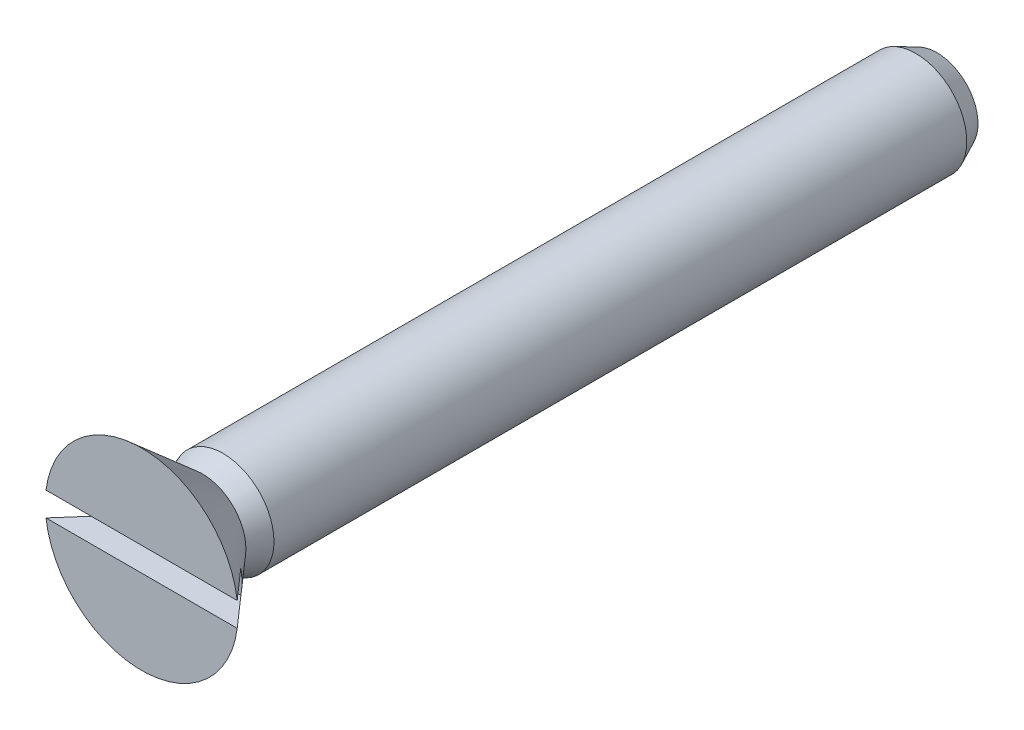
ISO-10303-21;
HEADER;
FILE_DESCRIPTION(('STEP AP214'),'2;1');
FILE_NAME('part.step','',(''),(''),'','','');
FILE_SCHEMA(('AUTOMOTIVE_DESIGN { 1 0 10303 214 1 1 1 1 }'));
ENDSEC;
DATA;
#1=APPLICATION_CONTEXT('core data for automotive mechanical design processes');
#2=APPLICATION_PROTOCOL_DEFINITION('international standard','automotive_design',2000,#1);
#3=PRODUCT_CONTEXT('',#1,'mechanical');
#4=PRODUCT('Part','Part','',(#3));
#5=PRODUCT_RELATED_PRODUCT_CATEGORY('part','',(#4));
#6=PRODUCT_DEFINITION_FORMATION('','',#4);
#7=PRODUCT_DEFINITION_CONTEXT('part definition',#1,'design');
#8=PRODUCT_DEFINITION('design','',#6,#7);
#9=PRODUCT_DEFINITION_SHAPE('','',#8);
#10=(LENGTH_UNIT() NAMED_UNIT(*) SI_UNIT(.MILLI.,.METRE.));
#11=(NAMED_UNIT(*) PLANE_ANGLE_UNIT() SI_UNIT($,.RADIAN.));
#12=(NAMED_UNIT(*) SI_UNIT($,.STERADIAN.) SOLID_ANGLE_UNIT());
#13=UNCERTAINTY_MEASURE_WITH_UNIT(LENGTH_MEASURE(1.E-05),#10,'distance_accuracy_value','');
#14=(GEOMETRIC_REPRESENTATION_CONTEXT(3) GLOBAL_UNCERTAINTY_ASSIGNED_CONTEXT((#13)) GLOBAL_UNIT_ASSIGNED_CONTEXT((#10,
#11,#12)) REPRESENTATION_CONTEXT('',''));
#15=CARTESIAN_POINT('',(0.,0.,0.));
#16=DIRECTION('',(0.,0.,1.));
#17=DIRECTION('',(1.,0.,0.));
#18=AXIS2_PLACEMENT_3D('',#15,#16,#17);
#19=CARTESIAN_POINT('',(-2.703338205,-2.7065351,1.7018));
#20=DIRECTION('',(0.,0.,1.));
#21=DIRECTION('',(1.,0.,0.));
#22=AXIS2_PLACEMENT_3D('',#19,#20,#21);
#23=PLANE('',#22);
#24=DIRECTION('',(-1.,0.,0.));
#25=VECTOR('',#24,1.);
#26=CARTESIAN_POINT('',(0.,-0.33655,1.7018));
#27=LINE('',#26,#25);
#28=CARTESIAN_POINT('',(2.6712828109945,-0.33655,1.70179999974678));
#29=VERTEX_POINT('',#28);
#30=CARTESIAN_POINT('',(-2.6712828112164,-0.33655,1.70180000000004));
#31=VERTEX_POINT('',#30);
#32=EDGE_CURVE('E68',#29,#31,#27,.T.);
#33=ORIENTED_EDGE('',*,*,#32,.T.);
#34=CARTESIAN_POINT('',(0.,0.,1.70180000000009));
#35=DIRECTION('',(0.,0.,1.));
#36=DIRECTION('',(1.,0.,0.));
#37=AXIS2_PLACEMENT_3D('',#34,#35,#36);
#38=CIRCLE('',#37,2.69240000000007);
#39=EDGE_CURVE('E21',#31,#29,#38,.T.);
#40=ORIENTED_EDGE('',*,*,#39,.T.);
#41=EDGE_LOOP('',(#33,#40));
#42=FACE_BOUND('',#41,.T.);
#43=ADVANCED_FACE('F17',(#42),#23,.T.);
#44=CARTESIAN_POINT('',(-2.703338205,-0.33655,1.7018));
#45=DIRECTION('',(0.,-1.,0.));
#46=DIRECTION('',(0.,0.,-1.));
#47=AXIS2_PLACEMENT_3D('',#44,#45,#46);
#48=PLANE('',#47);
#49=CARTESIAN_POINT('',(1.92350325844433,-0.33655,0.850899999862454));
#50=CARTESIAN_POINT('',(1.9859639495517,-0.33655,0.921680159299777));
#51=CARTESIAN_POINT('',(2.04837643865772,-0.33655,0.992502813507704));
#52=CARTESIAN_POINT('',(2.17312353425763,-0.33655,1.13421658957777));
#53=CARTESIAN_POINT('',(2.23545814081127,-0.33655,1.20510771138731));
#54=CARTESIAN_POINT('',(2.36006806783732,-0.33655,1.34694198593339));
#55=CARTESIAN_POINT('',(2.42234338832941,-0.33655,1.41788513865265));
#56=CARTESIAN_POINT('',(2.54684616813442,-0.33655,1.55981352687141));
#57=CARTESIAN_POINT('',(2.60907362741087,-0.33655,1.63079876240291));
#58=CARTESIAN_POINT('',(2.67128281077197,-0.33655,1.70179999949279));
#59=B_SPLINE_CURVE_WITH_KNOTS('',3,(#49,#50,#51,#52,#53,#54,#55,#56,#57,#58),.UNSPECIFIED.,.F.,
.F.,(4,2,2,2,4),(0.,0.283196897063513,0.566393576787468,0.849590162542826,1.13278696391779),.UNSPECIFIED.);
#60=CARTESIAN_POINT('',(1.92350325850502,-0.33655,0.850899999931221));
#61=VERTEX_POINT('',#60);
#62=EDGE_CURVE('E75',#61,#29,#59,.T.);
#63=ORIENTED_EDGE('',*,*,#62,.F.);
#64=DIRECTION('',(1.,0.,0.));
#65=VECTOR('',#64,1.);
#66=CARTESIAN_POINT('',(0.,-0.33655,0.8509));
#67=LINE('',#66,#65);
#68=CARTESIAN_POINT('',(-1.92350325850162,-0.33655,0.85089999992737));
#69=VERTEX_POINT('',#68);
#70=EDGE_CURVE('E65',#69,#61,#67,.T.);
#71=ORIENTED_EDGE('',*,*,#70,.F.);
#72=CARTESIAN_POINT('',(-2.67128281062004,-0.336549999786952,1.70179999961349));
#73=CARTESIAN_POINT('',(-2.60907362735201,-0.336549999923066,1.63079876244194));
#74=CARTESIAN_POINT('',(-2.54684616811398,-0.336549999979287,1.55981352687668));
#75=CARTESIAN_POINT('',(-2.42234338833724,-0.336550000020713,1.41788513863301));
#76=CARTESIAN_POINT('',(-2.36006806783501,-0.336550000005918,1.3469419859226));
#77=CARTESIAN_POINT('',(-2.23545814080083,-0.336549999994082,1.20510771138359));
#78=CARTESIAN_POINT('',(-2.17312353424921,-0.336549999997041,1.13421658957227));
#79=CARTESIAN_POINT('',(-2.04837643865332,-0.336550000002959,0.992502813498639));
#80=CARTESIAN_POINT('',(-1.98596394954931,-0.336550000005918,0.921680159288919));
#81=CARTESIAN_POINT('',(-1.92350325843787,-0.33655,0.850899999855127));
#82=B_SPLINE_CURVE_WITH_KNOTS('',3,(#72,#73,#74,#75,#76,#77,#78,#79,#80,#81),.UNSPECIFIED.,.F.,
.F.,(4,2,2,2,4),(0.,0.283196801375141,0.566393387130615,0.849590066854572,1.13278696391817),.UNSPECIFIED.);
#83=EDGE_CURVE('E71',#31,#69,#82,.T.);
#84=ORIENTED_EDGE('',*,*,#83,.F.);
#85=ORIENTED_EDGE('',*,*,#32,.F.);
#86=EDGE_LOOP('',(#63,#71,#84,#85));
#87=FACE_BOUND('',#86,.T.);
#88=ADVANCED_FACE('F77',(#87),#48,.F.);
#89=CARTESIAN_POINT('',(-1.161243369,-1.161243369,-20.5232));
#90=DIRECTION('',(0.,0.,1.));
#91=DIRECTION('',(1.,0.,0.));
#92=AXIS2_PLACEMENT_3D('',#89,#90,#91);
#93=PLANE('',#92);
#94=CARTESIAN_POINT('',(0.,0.,-20.5232));
#95=DIRECTION('',(0.,0.,1.));
#96=DIRECTION('',(1.,0.,0.));
#97=AXIS2_PLACEMENT_3D('',#94,#95,#96);
#98=CIRCLE('',#97,1.14747368400002);
#99=CARTESIAN_POINT('',(1.14747368400002,0.,-20.5232));
#100=VERTEX_POINT('',#99);
#101=EDGE_CURVE('E80',#100,#100,#98,.F.);
#102=ORIENTED_EDGE('',*,*,#101,.T.);
#103=EDGE_LOOP('',(#102));
#104=FACE_BOUND('',#103,.T.);
#105=ADVANCED_FACE('F115',(#104),#93,.F.);
#106=CARTESIAN_POINT('',(-1.976156602,-0.33655,0.8509));
#107=DIRECTION('',(0.,0.,1.));
#108=DIRECTION('',(1.,0.,0.));
#109=AXIS2_PLACEMENT_3D('',#106,#107,#108);
#110=PLANE('',#109);
#111=CARTESIAN_POINT('',(0.,0.,0.850899999999988));
#112=DIRECTION('',(0.,0.,1.));
#113=DIRECTION('',(1.,0.,0.));
#114=AXIS2_PLACEMENT_3D('',#111,#112,#113);
#115=CIRCLE('',#114,1.95272391499999);
#116=CARTESIAN_POINT('',(1.92350325860631,0.33655,0.850900000046));
#117=VERTEX_POINT('',#116);
#118=EDGE_CURVE('E78',#61,#117,#115,.T.);
#119=ORIENTED_EDGE('',*,*,#118,.T.);
#120=DIRECTION('',(-1.,0.,0.));
#121=VECTOR('',#120,1.);
#122=CARTESIAN_POINT('',(0.,0.33655,0.8509));
#123=LINE('',#122,#121);
#124=CARTESIAN_POINT('',(-1.92350325856571,0.33655,0.850899999999994));
#125=VERTEX_POINT('',#124);
#126=EDGE_CURVE('E67',#117,#125,#123,.T.);
#127=ORIENTED_EDGE('',*,*,#126,.T.);
#128=CARTESIAN_POINT('',(0.,0.,0.850899999999988));
#129=DIRECTION('',(0.,0.,1.));
#130=DIRECTION('',(1.,0.,0.));
#131=AXIS2_PLACEMENT_3D('',#128,#129,#130);
#132=CIRCLE('',#131,1.95272391499999);
#133=EDGE_CURVE('E60',#125,#69,#132,.T.);
#134=ORIENTED_EDGE('',*,*,#133,.T.);
#135=ORIENTED_EDGE('',*,*,#70,.T.);
#136=EDGE_LOOP('',(#119,#127,#134,#135));
#137=FACE_BOUND('',#136,.T.);
#138=ADVANCED_FACE('F63',(#137),#110,.T.);
#139=CARTESIAN_POINT('',(0.,0.,-20.5232));
#140=DIRECTION('',(0.,0.,1.));
#141=DIRECTION('',(1.,0.,0.));
#142=AXIS2_PLACEMENT_3D('',#139,#140,#141);
#143=CONICAL_SURFACE('',#142,1.147473684,0.436332313838061);
#144=ORIENTED_EDGE('',*,*,#101,.F.);
#145=EDGE_LOOP('',(#144));
#146=FACE_BOUND('',#145,.T.);
#147=CARTESIAN_POINT('',(0.,0.,-19.933618614));
#148=DIRECTION('',(0.,0.,1.));
#149=DIRECTION('',(1.,0.,0.));
#150=AXIS2_PLACEMENT_3D('',#147,#148,#149);
#151=CIRCLE('',#150,1.4224);
#152=CARTESIAN_POINT('',(1.4224,0.,-19.933618614));
#153=VERTEX_POINT('',#152);
#154=EDGE_CURVE('E86',#153,#153,#151,.F.);
#155=ORIENTED_EDGE('',*,*,#154,.T.);
#156=EDGE_LOOP('',(#155));
#157=FACE_BOUND('',#156,.T.);
#158=ADVANCED_FACE('F110',(#146,#157),#143,.T.);
#159=CARTESIAN_POINT('',(-2.703338205,0.33655,0.8509));
#160=DIRECTION('',(0.,1.,0.));
#161=DIRECTION('',(0.,0.,1.));
#162=AXIS2_PLACEMENT_3D('',#159,#160,#161);
#163=PLANE('',#162);
#164=CARTESIAN_POINT('',(-1.92350325862954,0.33655,0.850900000072317));
#165=CARTESIAN_POINT('',(-1.98596394972039,0.33655,0.921680159491123));
#166=CARTESIAN_POINT('',(-2.04837643880992,0.33655,0.992502813680499));
#167=CARTESIAN_POINT('',(-2.17312353437694,0.33655,1.13421658971341));
#168=CARTESIAN_POINT('',(-2.23545814091415,0.33655,1.20510771150436));
#169=CARTESIAN_POINT('',(-2.36006806790739,0.33655,1.3469419860132));
#170=CARTESIAN_POINT('',(-2.42234338838309,0.33655,1.41788513871383));
#171=CARTESIAN_POINT('',(-2.54684616815536,0.33655,1.5598135268953));
#172=CARTESIAN_POINT('',(-2.60907362741545,0.33655,1.63079876240814));
#173=CARTESIAN_POINT('',(-2.6712828107602,0.33655,1.70179999947936));
#174=B_SPLINE_CURVE_WITH_KNOTS('',3,(#164,#165,#166,#167,#168,#169,#170,#171,#172,#173),
.UNSPECIFIED.,.F.,.F.,(4,2,2,2,4),(0.,0.283196896989073,0.566393576638588,0.849590162319507,
1.13278696362003),.UNSPECIFIED.);
#175=CARTESIAN_POINT('',(-2.67128281098846,0.33655,1.70179999973988));
#176=VERTEX_POINT('',#175);
#177=EDGE_CURVE('E36',#125,#176,#174,.T.);
#178=ORIENTED_EDGE('',*,*,#177,.F.);
#179=ORIENTED_EDGE('',*,*,#126,.F.);
#180=CARTESIAN_POINT('',(2.67128281077779,0.33655,1.70179999949944));
#181=CARTESIAN_POINT('',(2.60907362743304,0.33655,1.63079876242821));
#182=CARTESIAN_POINT('',(2.54684616817293,0.33655,1.55981352691535));
#183=CARTESIAN_POINT('',(2.42234338840065,0.33655,1.41788513873384));
#184=CARTESIAN_POINT('',(2.36006806792495,0.33655,1.3469419860332));
#185=CARTESIAN_POINT('',(2.2354581409317,0.33655,1.20510771152432));
#186=CARTESIAN_POINT('',(2.17312353439448,0.33655,1.13421658973335));
#187=CARTESIAN_POINT('',(2.04837643882746,0.33655,0.992502813700402));
#188=CARTESIAN_POINT('',(1.98596394973792,0.33655,0.921680159511006));
#189=CARTESIAN_POINT('',(1.92350325864706,0.33655,0.85090000009218));
#190=B_SPLINE_CURVE_WITH_KNOTS('',3,(#180,#181,#182,#183,#184,#185,#186,#187,#188,#189),
.UNSPECIFIED.,.F.,.F.,(4,2,2,2,4),(0.,0.283196801300577,0.566393386981547,0.849590066631114,
1.13278696362024),.UNSPECIFIED.);
#191=CARTESIAN_POINT('',(2.67128281099708,0.33655,1.70179999974972));
#192=VERTEX_POINT('',#191);
#193=EDGE_CURVE('E98',#192,#117,#190,.T.);
#194=ORIENTED_EDGE('',*,*,#193,.F.);
#195=DIRECTION('',(1.,0.,0.));
#196=VECTOR('',#195,1.);
#197=CARTESIAN_POINT('',(0.,0.33655,1.7018));
#198=LINE('',#197,#196);
#199=EDGE_CURVE('E88',#176,#192,#198,.T.);
#200=ORIENTED_EDGE('',*,*,#199,.F.);
#201=EDGE_LOOP('',(#178,#179,#194,#200));
#202=FACE_BOUND('',#201,.T.);
#203=ADVANCED_FACE('F105',(#202),#163,.F.);
#204=CARTESIAN_POINT('',(0.,0.,-19.933618614));
#205=DIRECTION('',(0.,0.,1.));
#206=DIRECTION('',(1.,0.,0.));
#207=AXIS2_PLACEMENT_3D('',#204,#205,#206);
#208=CYLINDRICAL_SURFACE('',#207,1.4224);
#209=CARTESIAN_POINT('',(0.,0.,-0.575190361000066));
#210=DIRECTION('',(0.,0.,-1.));
#211=DIRECTION('',(-1.,0.,0.));
#212=AXIS2_PLACEMENT_3D('',#209,#210,#211);
#213=CIRCLE('',#212,1.4224);
#214=CARTESIAN_POINT('',(-1.4224,0.,-0.575190361));
#215=VERTEX_POINT('',#214);
#216=EDGE_CURVE('E92',#215,#215,#213,.T.);
#217=ORIENTED_EDGE('',*,*,#216,.T.);
#218=EDGE_LOOP('',(#217));
#219=FACE_BOUND('',#218,.T.);
#220=ORIENTED_EDGE('',*,*,#154,.F.);
#221=EDGE_LOOP('',(#220));
#222=FACE_BOUND('',#221,.T.);
#223=ADVANCED_FACE('F109',(#219,#222),#208,.T.);
#224=CARTESIAN_POINT('',(-2.703338205,0.33655,1.7018));
#225=DIRECTION('',(0.,0.,1.));
#226=DIRECTION('',(1.,0.,0.));
#227=AXIS2_PLACEMENT_3D('',#224,#225,#226);
#228=PLANE('',#227);
#229=ORIENTED_EDGE('',*,*,#199,.T.);
#230=CARTESIAN_POINT('',(0.,0.,1.7018));
#231=DIRECTION('',(0.,0.,1.));
#232=DIRECTION('',(1.,0.,0.));
#233=AXIS2_PLACEMENT_3D('',#230,#231,#232);
#234=CIRCLE('',#233,2.6924);
#235=EDGE_CURVE('E27',#192,#176,#234,.T.);
#236=ORIENTED_EDGE('',*,*,#235,.T.);
#237=EDGE_LOOP('',(#229,#236));
#238=FACE_BOUND('',#237,.T.);
#239=ADVANCED_FACE('F19',(#238),#228,.T.);
#240=CARTESIAN_POINT('',(0.,0.,0.));
#241=DIRECTION('',(0.,0.,-1.));
#242=DIRECTION('',(-1.,0.,0.));
#243=AXIS2_PLACEMENT_3D('',#240,#241,#242);
#244=CONICAL_SURFACE('',#243,1.21304783,0.349065849722109);
#245=CARTESIAN_POINT('',(0.,0.,0.));
#246=DIRECTION('',(0.,0.,1.));
#247=DIRECTION('',(1.,0.,0.));
#248=AXIS2_PLACEMENT_3D('',#245,#246,#247);
#249=CIRCLE('',#248,1.21304783);
#250=CARTESIAN_POINT('',(1.21304783,0.,0.));
#251=VERTEX_POINT('',#250);
#252=EDGE_CURVE('E11',#251,#251,#249,.F.);
#253=ORIENTED_EDGE('',*,*,#252,.T.);
#254=EDGE_LOOP('',(#253));
#255=FACE_BOUND('',#254,.T.);
#256=ORIENTED_EDGE('',*,*,#216,.F.);
#257=EDGE_LOOP('',(#256));
#258=FACE_BOUND('',#257,.T.);
#259=ADVANCED_FACE('F136',(#255,#258),#244,.T.);
#260=CARTESIAN_POINT('',(0.,0.,0.));
#261=DIRECTION('',(0.,0.,1.));
#262=DIRECTION('',(1.,0.,0.));
#263=AXIS2_PLACEMENT_3D('',#260,#261,#262);
#264=CONICAL_SURFACE('',#263,1.21304783,0.715584993178557);
#265=ORIENTED_EDGE('',*,*,#252,.F.);
#266=EDGE_LOOP('',(#265));
#267=FACE_BOUND('',#266,.T.);
#268=ORIENTED_EDGE('',*,*,#118,.F.);
#269=ORIENTED_EDGE('',*,*,#62,.T.);
#270=ORIENTED_EDGE('',*,*,#39,.F.);
#271=ORIENTED_EDGE('',*,*,#83,.T.);
#272=ORIENTED_EDGE('',*,*,#133,.F.);
#273=ORIENTED_EDGE('',*,*,#177,.T.);
#274=ORIENTED_EDGE('',*,*,#235,.F.);
#275=ORIENTED_EDGE('',*,*,#193,.T.);
#276=EDGE_LOOP('',(#268,#269,#270,#271,#272,#273,#274,#275));
#277=FACE_BOUND('',#276,.T.);
#278=ADVANCED_FACE('F72',(#267,#277),#264,.T.);
#279=CLOSED_SHELL('',(#43,#88,#105,#138,#158,#203,#223,#239,#259,#278));
#280=MANIFOLD_SOLID_BREP('B1',#279);
#281=ADVANCED_BREP_SHAPE_REPRESENTATION('',(#18,#280),#14);
#282=SHAPE_DEFINITION_REPRESENTATION(#9,#281);
ENDSEC;
END-ISO-10303-21;
